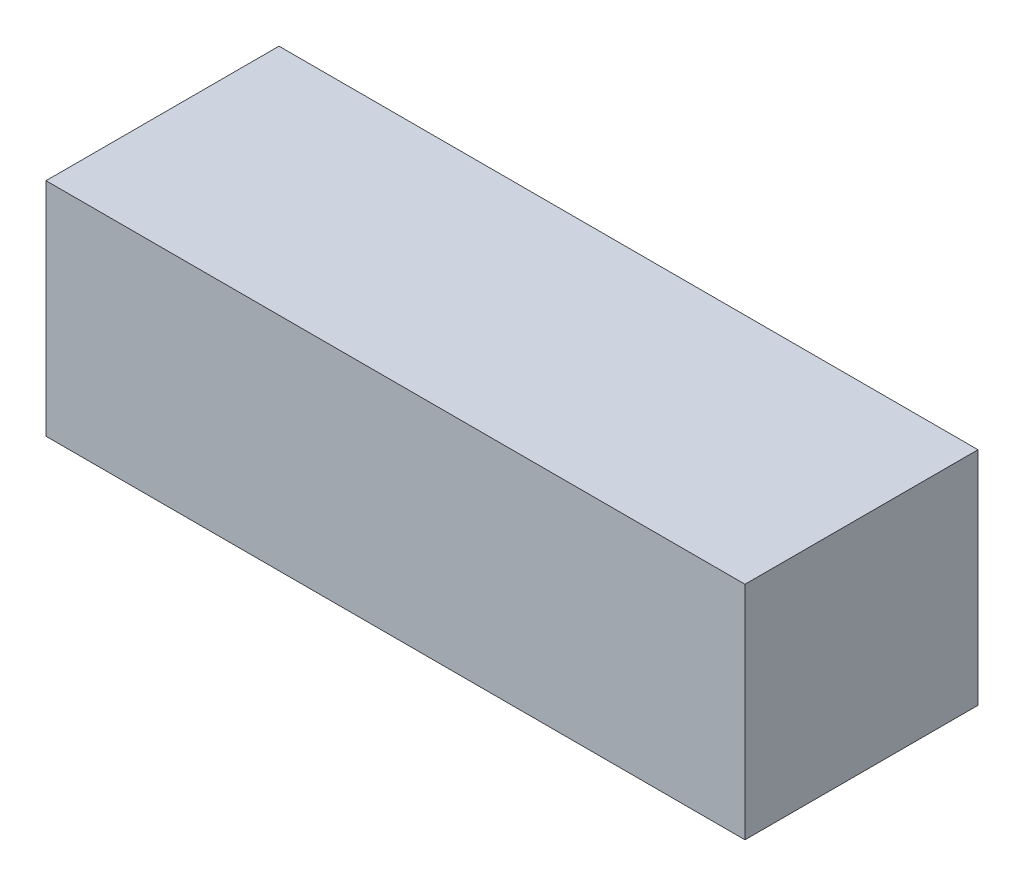
ISO-10303-21;
HEADER;
FILE_DESCRIPTION(('STEP AP214'),'2;1');
FILE_NAME('part.step','',(''),(''),'','','');
FILE_SCHEMA(('AUTOMOTIVE_DESIGN { 1 0 10303 214 1 1 1 1 }'));
ENDSEC;
DATA;
#1=APPLICATION_CONTEXT('core data for automotive mechanical design processes');
#2=APPLICATION_PROTOCOL_DEFINITION('international standard','automotive_design',2000,#1);
#3=PRODUCT_CONTEXT('',#1,'mechanical');
#4=PRODUCT('Part','Part','',(#3));
#5=PRODUCT_RELATED_PRODUCT_CATEGORY('part','',(#4));
#6=PRODUCT_DEFINITION_FORMATION('','',#4);
#7=PRODUCT_DEFINITION_CONTEXT('part definition',#1,'design');
#8=PRODUCT_DEFINITION('design','',#6,#7);
#9=PRODUCT_DEFINITION_SHAPE('','',#8);
#10=(LENGTH_UNIT() NAMED_UNIT(*) SI_UNIT(.MILLI.,.METRE.));
#11=(NAMED_UNIT(*) PLANE_ANGLE_UNIT() SI_UNIT($,.RADIAN.));
#12=(NAMED_UNIT(*) SI_UNIT($,.STERADIAN.) SOLID_ANGLE_UNIT());
#13=UNCERTAINTY_MEASURE_WITH_UNIT(LENGTH_MEASURE(1.E-05),#10,'distance_accuracy_value','');
#14=(GEOMETRIC_REPRESENTATION_CONTEXT(3) GLOBAL_UNCERTAINTY_ASSIGNED_CONTEXT((#13)) GLOBAL_UNIT_ASSIGNED_CONTEXT((#10,
#11,#12)) REPRESENTATION_CONTEXT('',''));
#15=CARTESIAN_POINT('',(0.,0.,0.));
#16=DIRECTION('',(0.,0.,1.));
#17=DIRECTION('',(1.,0.,0.));
#18=AXIS2_PLACEMENT_3D('',#15,#16,#17);
#19=CARTESIAN_POINT('',(-63.,-19.,20.));
#20=DIRECTION('',(-1.,0.,0.));
#21=DIRECTION('',(0.,0.,1.));
#22=AXIS2_PLACEMENT_3D('',#19,#20,#21);
#23=PLANE('',#22);
#24=DIRECTION('',(0.,1.,0.));
#25=VECTOR('',#24,1.);
#26=CARTESIAN_POINT('',(-63.,-19.,20.));
#27=LINE('',#26,#25);
#28=CARTESIAN_POINT('',(-63.,-19.,20.));
#29=VERTEX_POINT('',#28);
#30=CARTESIAN_POINT('',(-63.,19.,20.));
#31=VERTEX_POINT('',#30);
#32=EDGE_CURVE('E53',#29,#31,#27,.T.);
#33=ORIENTED_EDGE('',*,*,#32,.T.);
#34=DIRECTION('',(0.,0.,1.));
#35=VECTOR('',#34,1.);
#36=CARTESIAN_POINT('',(-63.,19.,20.));
#37=LINE('',#36,#35);
#38=CARTESIAN_POINT('',(-63.,19.,-20.));
#39=VERTEX_POINT('',#38);
#40=EDGE_CURVE('E90',#39,#31,#37,.T.);
#41=ORIENTED_EDGE('',*,*,#40,.F.);
#42=DIRECTION('',(0.,1.,0.));
#43=VECTOR('',#42,1.);
#44=CARTESIAN_POINT('',(-63.,-19.,-20.));
#45=LINE('',#44,#43);
#46=CARTESIAN_POINT('',(-63.,-19.,-20.));
#47=VERTEX_POINT('',#46);
#48=EDGE_CURVE('E12',#47,#39,#45,.T.);
#49=ORIENTED_EDGE('',*,*,#48,.F.);
#50=DIRECTION('',(0.,0.,1.));
#51=VECTOR('',#50,1.);
#52=CARTESIAN_POINT('',(-63.,-19.,20.));
#53=LINE('',#52,#51);
#54=EDGE_CURVE('E91',#47,#29,#53,.T.);
#55=ORIENTED_EDGE('',*,*,#54,.T.);
#56=EDGE_LOOP('',(#33,#41,#49,#55));
#57=FACE_BOUND('',#56,.T.);
#58=ADVANCED_FACE('F50',(#57),#23,.T.);
#59=CARTESIAN_POINT('',(-63.,-19.,-20.));
#60=DIRECTION('',(0.,0.,-1.));
#61=DIRECTION('',(-1.,0.,0.));
#62=AXIS2_PLACEMENT_3D('',#59,#60,#61);
#63=PLANE('',#62);
#64=ORIENTED_EDGE('',*,*,#48,.T.);
#65=DIRECTION('',(-1.,0.,0.));
#66=VECTOR('',#65,1.);
#67=CARTESIAN_POINT('',(-63.,19.,-20.));
#68=LINE('',#67,#66);
#69=CARTESIAN_POINT('',(57.,19.,-20.));
#70=VERTEX_POINT('',#69);
#71=EDGE_CURVE('E107',#70,#39,#68,.T.);
#72=ORIENTED_EDGE('',*,*,#71,.F.);
#73=DIRECTION('',(0.,1.,0.));
#74=VECTOR('',#73,1.);
#75=CARTESIAN_POINT('',(57.,-19.,-20.));
#76=LINE('',#75,#74);
#77=CARTESIAN_POINT('',(57.,-19.,-20.));
#78=VERTEX_POINT('',#77);
#79=EDGE_CURVE('E58',#78,#70,#76,.T.);
#80=ORIENTED_EDGE('',*,*,#79,.F.);
#81=DIRECTION('',(-1.,0.,0.));
#82=VECTOR('',#81,1.);
#83=CARTESIAN_POINT('',(-63.,-19.,-20.));
#84=LINE('',#83,#82);
#85=EDGE_CURVE('E96',#78,#47,#84,.T.);
#86=ORIENTED_EDGE('',*,*,#85,.T.);
#87=EDGE_LOOP('',(#64,#72,#80,#86));
#88=FACE_BOUND('',#87,.T.);
#89=ADVANCED_FACE('F122',(#88),#63,.T.);
#90=CARTESIAN_POINT('',(57.,-19.,20.));
#91=DIRECTION('',(1.,0.,0.));
#92=DIRECTION('',(0.,0.,-1.));
#93=AXIS2_PLACEMENT_3D('',#90,#91,#92);
#94=PLANE('',#93);
#95=ORIENTED_EDGE('',*,*,#79,.T.);
#96=DIRECTION('',(0.,0.,-1.));
#97=VECTOR('',#96,1.);
#98=CARTESIAN_POINT('',(57.,19.,20.));
#99=LINE('',#98,#97);
#100=CARTESIAN_POINT('',(57.,19.,20.));
#101=VERTEX_POINT('',#100);
#102=EDGE_CURVE('E103',#101,#70,#99,.T.);
#103=ORIENTED_EDGE('',*,*,#102,.F.);
#104=DIRECTION('',(0.,1.,0.));
#105=VECTOR('',#104,1.);
#106=CARTESIAN_POINT('',(57.,-19.,20.));
#107=LINE('',#106,#105);
#108=CARTESIAN_POINT('',(57.,-19.,20.));
#109=VERTEX_POINT('',#108);
#110=EDGE_CURVE('E95',#109,#101,#107,.T.);
#111=ORIENTED_EDGE('',*,*,#110,.F.);
#112=DIRECTION('',(0.,0.,-1.));
#113=VECTOR('',#112,1.);
#114=CARTESIAN_POINT('',(57.,-19.,20.));
#115=LINE('',#114,#113);
#116=EDGE_CURVE('E115',#109,#78,#115,.T.);
#117=ORIENTED_EDGE('',*,*,#116,.T.);
#118=EDGE_LOOP('',(#95,#103,#111,#117));
#119=FACE_BOUND('',#118,.T.);
#120=ADVANCED_FACE('F119',(#119),#94,.T.);
#121=CARTESIAN_POINT('',(-63.,-19.,20.));
#122=DIRECTION('',(0.,0.,1.));
#123=DIRECTION('',(1.,0.,0.));
#124=AXIS2_PLACEMENT_3D('',#121,#122,#123);
#125=PLANE('',#124);
#126=ORIENTED_EDGE('',*,*,#110,.T.);
#127=DIRECTION('',(1.,0.,0.));
#128=VECTOR('',#127,1.);
#129=CARTESIAN_POINT('',(-63.,19.,20.));
#130=LINE('',#129,#128);
#131=EDGE_CURVE('E98',#31,#101,#130,.T.);
#132=ORIENTED_EDGE('',*,*,#131,.F.);
#133=ORIENTED_EDGE('',*,*,#32,.F.);
#134=DIRECTION('',(1.,0.,0.));
#135=VECTOR('',#134,1.);
#136=CARTESIAN_POINT('',(-63.,-19.,20.));
#137=LINE('',#136,#135);
#138=EDGE_CURVE('E113',#29,#109,#137,.T.);
#139=ORIENTED_EDGE('',*,*,#138,.T.);
#140=EDGE_LOOP('',(#126,#132,#133,#139));
#141=FACE_BOUND('',#140,.T.);
#142=ADVANCED_FACE('F99',(#141),#125,.T.);
#143=CARTESIAN_POINT('',(0.,-19.,0.));
#144=DIRECTION('',(0.,-1.,0.));
#145=DIRECTION('',(0.,0.,-1.));
#146=AXIS2_PLACEMENT_3D('',#143,#144,#145);
#147=PLANE('',#146);
#148=ORIENTED_EDGE('',*,*,#54,.F.);
#149=ORIENTED_EDGE('',*,*,#85,.F.);
#150=ORIENTED_EDGE('',*,*,#116,.F.);
#151=ORIENTED_EDGE('',*,*,#138,.F.);
#152=EDGE_LOOP('',(#148,#149,#150,#151));
#153=FACE_BOUND('',#152,.T.);
#154=ADVANCED_FACE('F124',(#153),#147,.T.);
#155=CARTESIAN_POINT('',(0.,19.,0.));
#156=DIRECTION('',(0.,-1.,0.));
#157=DIRECTION('',(0.,0.,-1.));
#158=AXIS2_PLACEMENT_3D('',#155,#156,#157);
#159=PLANE('',#158);
#160=ORIENTED_EDGE('',*,*,#40,.T.);
#161=ORIENTED_EDGE('',*,*,#131,.T.);
#162=ORIENTED_EDGE('',*,*,#102,.T.);
#163=ORIENTED_EDGE('',*,*,#71,.T.);
#164=EDGE_LOOP('',(#160,#161,#162,#163));
#165=FACE_BOUND('',#164,.T.);
#166=ADVANCED_FACE('F106',(#165),#159,.F.);
#167=CLOSED_SHELL('',(#58,#89,#120,#142,#154,#166));
#168=MANIFOLD_SOLID_BREP('B2',#167);
#169=CARTESIAN_POINT('',(55.,-14.,17.5));
#170=DIRECTION('',(1.,0.,0.));
#171=DIRECTION('',(0.,0.,-1.));
#172=AXIS2_PLACEMENT_3D('',#169,#170,#171);
#173=PLANE('',#172);
#174=DIRECTION('',(0.,1.,0.));
#175=VECTOR('',#174,1.);
#176=CARTESIAN_POINT('',(55.,-14.,-17.5));
#177=LINE('',#176,#175);
#178=CARTESIAN_POINT('',(55.,-14.,-17.5));
#179=VERTEX_POINT('',#178);
#180=CARTESIAN_POINT('',(55.,14.,-17.5));
#181=VERTEX_POINT('',#180);
#182=EDGE_CURVE('E188',#179,#181,#177,.T.);
#183=ORIENTED_EDGE('',*,*,#182,.T.);
#184=DIRECTION('',(0.,0.,-1.));
#185=VECTOR('',#184,1.);
#186=CARTESIAN_POINT('',(55.,14.,17.5));
#187=LINE('',#186,#185);
#188=CARTESIAN_POINT('',(55.,14.,17.5));
#189=VERTEX_POINT('',#188);
#190=EDGE_CURVE('E225',#189,#181,#187,.T.);
#191=ORIENTED_EDGE('',*,*,#190,.F.);
#192=DIRECTION('',(0.,1.,0.));
#193=VECTOR('',#192,1.);
#194=CARTESIAN_POINT('',(55.,-14.,17.5));
#195=LINE('',#194,#193);
#196=CARTESIAN_POINT('',(55.,-14.,17.5));
#197=VERTEX_POINT('',#196);
#198=EDGE_CURVE('E48',#197,#189,#195,.T.);
#199=ORIENTED_EDGE('',*,*,#198,.F.);
#200=DIRECTION('',(0.,0.,-1.));
#201=VECTOR('',#200,1.);
#202=CARTESIAN_POINT('',(55.,-14.,17.5));
#203=LINE('',#202,#201);
#204=EDGE_CURVE('E226',#197,#179,#203,.T.);
#205=ORIENTED_EDGE('',*,*,#204,.T.);
#206=EDGE_LOOP('',(#183,#191,#199,#205));
#207=FACE_BOUND('',#206,.T.);
#208=ADVANCED_FACE('F185',(#207),#173,.T.);
#209=CARTESIAN_POINT('',(-55.,-14.,17.5));
#210=DIRECTION('',(0.,0.,1.));
#211=DIRECTION('',(1.,0.,0.));
#212=AXIS2_PLACEMENT_3D('',#209,#210,#211);
#213=PLANE('',#212);
#214=ORIENTED_EDGE('',*,*,#198,.T.);
#215=DIRECTION('',(1.,0.,0.));
#216=VECTOR('',#215,1.);
#217=CARTESIAN_POINT('',(-55.,14.,17.5));
#218=LINE('',#217,#216);
#219=CARTESIAN_POINT('',(-55.,14.,17.5));
#220=VERTEX_POINT('',#219);
#221=EDGE_CURVE('E242',#220,#189,#218,.T.);
#222=ORIENTED_EDGE('',*,*,#221,.F.);
#223=DIRECTION('',(0.,1.,0.));
#224=VECTOR('',#223,1.);
#225=CARTESIAN_POINT('',(-55.,-14.,17.5));
#226=LINE('',#225,#224);
#227=CARTESIAN_POINT('',(-55.,-14.,17.5));
#228=VERTEX_POINT('',#227);
#229=EDGE_CURVE('E193',#228,#220,#226,.T.);
#230=ORIENTED_EDGE('',*,*,#229,.F.);
#231=DIRECTION('',(1.,0.,0.));
#232=VECTOR('',#231,1.);
#233=CARTESIAN_POINT('',(-55.,-14.,17.5));
#234=LINE('',#233,#232);
#235=EDGE_CURVE('E231',#228,#197,#234,.T.);
#236=ORIENTED_EDGE('',*,*,#235,.T.);
#237=EDGE_LOOP('',(#214,#222,#230,#236));
#238=FACE_BOUND('',#237,.T.);
#239=ADVANCED_FACE('F257',(#238),#213,.T.);
#240=CARTESIAN_POINT('',(-55.,-14.,17.5));
#241=DIRECTION('',(-1.,0.,0.));
#242=DIRECTION('',(0.,0.,1.));
#243=AXIS2_PLACEMENT_3D('',#240,#241,#242);
#244=PLANE('',#243);
#245=ORIENTED_EDGE('',*,*,#229,.T.);
#246=DIRECTION('',(0.,0.,1.));
#247=VECTOR('',#246,1.);
#248=CARTESIAN_POINT('',(-55.,14.,17.5));
#249=LINE('',#248,#247);
#250=CARTESIAN_POINT('',(-55.,14.,-17.5));
#251=VERTEX_POINT('',#250);
#252=EDGE_CURVE('E238',#251,#220,#249,.T.);
#253=ORIENTED_EDGE('',*,*,#252,.F.);
#254=DIRECTION('',(0.,1.,0.));
#255=VECTOR('',#254,1.);
#256=CARTESIAN_POINT('',(-55.,-14.,-17.5));
#257=LINE('',#256,#255);
#258=CARTESIAN_POINT('',(-55.,-14.,-17.5));
#259=VERTEX_POINT('',#258);
#260=EDGE_CURVE('E230',#259,#251,#257,.T.);
#261=ORIENTED_EDGE('',*,*,#260,.F.);
#262=DIRECTION('',(0.,0.,1.));
#263=VECTOR('',#262,1.);
#264=CARTESIAN_POINT('',(-55.,-14.,17.5));
#265=LINE('',#264,#263);
#266=EDGE_CURVE('E250',#259,#228,#265,.T.);
#267=ORIENTED_EDGE('',*,*,#266,.T.);
#268=EDGE_LOOP('',(#245,#253,#261,#267));
#269=FACE_BOUND('',#268,.T.);
#270=ADVANCED_FACE('F254',(#269),#244,.T.);
#271=CARTESIAN_POINT('',(-55.,-14.,-17.5));
#272=DIRECTION('',(0.,0.,-1.));
#273=DIRECTION('',(-1.,0.,0.));
#274=AXIS2_PLACEMENT_3D('',#271,#272,#273);
#275=PLANE('',#274);
#276=ORIENTED_EDGE('',*,*,#260,.T.);
#277=DIRECTION('',(-1.,0.,0.));
#278=VECTOR('',#277,1.);
#279=CARTESIAN_POINT('',(-55.,14.,-17.5));
#280=LINE('',#279,#278);
#281=EDGE_CURVE('E233',#181,#251,#280,.T.);
#282=ORIENTED_EDGE('',*,*,#281,.F.);
#283=ORIENTED_EDGE('',*,*,#182,.F.);
#284=DIRECTION('',(-1.,0.,0.));
#285=VECTOR('',#284,1.);
#286=CARTESIAN_POINT('',(-55.,-14.,-17.5));
#287=LINE('',#286,#285);
#288=EDGE_CURVE('E248',#179,#259,#287,.T.);
#289=ORIENTED_EDGE('',*,*,#288,.T.);
#290=EDGE_LOOP('',(#276,#282,#283,#289));
#291=FACE_BOUND('',#290,.T.);
#292=ADVANCED_FACE('F234',(#291),#275,.T.);
#293=CARTESIAN_POINT('',(0.,-14.,0.));
#294=DIRECTION('',(0.,-1.,0.));
#295=DIRECTION('',(0.,0.,-1.));
#296=AXIS2_PLACEMENT_3D('',#293,#294,#295);
#297=PLANE('',#296);
#298=ORIENTED_EDGE('',*,*,#204,.F.);
#299=ORIENTED_EDGE('',*,*,#235,.F.);
#300=ORIENTED_EDGE('',*,*,#266,.F.);
#301=ORIENTED_EDGE('',*,*,#288,.F.);
#302=EDGE_LOOP('',(#298,#299,#300,#301));
#303=FACE_BOUND('',#302,.T.);
#304=ADVANCED_FACE('F259',(#303),#297,.T.);
#305=CARTESIAN_POINT('',(0.,14.,0.));
#306=DIRECTION('',(0.,-1.,0.));
#307=DIRECTION('',(0.,0.,-1.));
#308=AXIS2_PLACEMENT_3D('',#305,#306,#307);
#309=PLANE('',#308);
#310=ORIENTED_EDGE('',*,*,#190,.T.);
#311=ORIENTED_EDGE('',*,*,#281,.T.);
#312=ORIENTED_EDGE('',*,*,#252,.T.);
#313=ORIENTED_EDGE('',*,*,#221,.T.);
#314=EDGE_LOOP('',(#310,#311,#312,#313));
#315=FACE_BOUND('',#314,.T.);
#316=ADVANCED_FACE('F241',(#315),#309,.F.);
#317=CLOSED_SHELL('',(#208,#239,#270,#292,#304,#316));
#318=MANIFOLD_SOLID_BREP('B6',#317);
#319=ADVANCED_BREP_SHAPE_REPRESENTATION('',(#18,#168,#318),#14);
#320=SHAPE_DEFINITION_REPRESENTATION(#9,#319);
ENDSEC;
END-ISO-10303-21;
